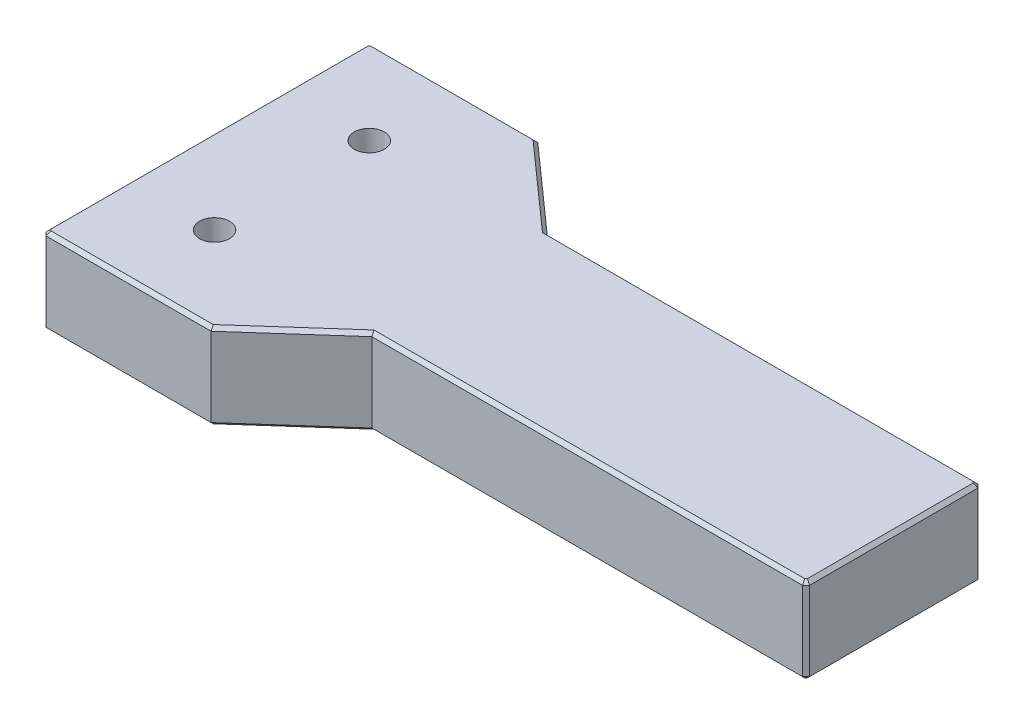
ISO-10303-21;
HEADER;
FILE_DESCRIPTION(('STEP AP214'),'2;1');
FILE_NAME('part.step','',(''),(''),'','','');
FILE_SCHEMA(('AUTOMOTIVE_DESIGN { 1 0 10303 214 1 1 1 1 }'));
ENDSEC;
DATA;
#1=APPLICATION_CONTEXT('core data for automotive mechanical design processes');
#2=APPLICATION_PROTOCOL_DEFINITION('international standard','automotive_design',2000,#1);
#3=PRODUCT_CONTEXT('',#1,'mechanical');
#4=PRODUCT('Part','Part','',(#3));
#5=PRODUCT_RELATED_PRODUCT_CATEGORY('part','',(#4));
#6=PRODUCT_DEFINITION_FORMATION('','',#4);
#7=PRODUCT_DEFINITION_CONTEXT('part definition',#1,'design');
#8=PRODUCT_DEFINITION('design','',#6,#7);
#9=PRODUCT_DEFINITION_SHAPE('','',#8);
#10=(LENGTH_UNIT() NAMED_UNIT(*) SI_UNIT(.MILLI.,.METRE.));
#11=(NAMED_UNIT(*) PLANE_ANGLE_UNIT() SI_UNIT($,.RADIAN.));
#12=(NAMED_UNIT(*) SI_UNIT($,.STERADIAN.) SOLID_ANGLE_UNIT());
#13=UNCERTAINTY_MEASURE_WITH_UNIT(LENGTH_MEASURE(1.E-05),#10,'distance_accuracy_value','');
#14=(GEOMETRIC_REPRESENTATION_CONTEXT(3) GLOBAL_UNCERTAINTY_ASSIGNED_CONTEXT((#13)) GLOBAL_UNIT_ASSIGNED_CONTEXT((#10,
#11,#12)) REPRESENTATION_CONTEXT('',''));
#15=CARTESIAN_POINT('',(0.,0.,0.));
#16=DIRECTION('',(0.,0.,1.));
#17=DIRECTION('',(1.,0.,0.));
#18=AXIS2_PLACEMENT_3D('',#15,#16,#17);
#19=CARTESIAN_POINT('',(-70.,3.,3.));
#20=DIRECTION('',(0.,-1.,0.));
#21=DIRECTION('',(1.,0.,0.));
#22=AXIS2_PLACEMENT_3D('',#19,#20,#21);
#23=CYLINDRICAL_SURFACE('',#22,1.75);
#24=CARTESIAN_POINT('',(-70.,-10.,3.));
#25=DIRECTION('',(0.,1.,0.));
#26=DIRECTION('',(1.,0.,0.));
#27=AXIS2_PLACEMENT_3D('',#24,#25,#26);
#28=CIRCLE('',#27,1.75);
#29=CARTESIAN_POINT('',(-68.25,-10.,3.));
#30=VERTEX_POINT('',#29);
#31=EDGE_CURVE('E19',#30,#30,#28,.T.);
#32=ORIENTED_EDGE('',*,*,#31,.F.);
#33=EDGE_LOOP('',(#32));
#34=FACE_BOUND('',#33,.T.);
#35=CARTESIAN_POINT('',(-70.,0.,3.));
#36=DIRECTION('',(0.,-1.,0.));
#37=DIRECTION('',(1.,0.,0.));
#38=AXIS2_PLACEMENT_3D('',#35,#36,#37);
#39=CIRCLE('',#38,1.75);
#40=CARTESIAN_POINT('',(-68.25,0.,3.));
#41=VERTEX_POINT('',#40);
#42=EDGE_CURVE('E115',#41,#41,#39,.T.);
#43=ORIENTED_EDGE('',*,*,#42,.F.);
#44=EDGE_LOOP('',(#43));
#45=FACE_BOUND('',#44,.T.);
#46=ADVANCED_FACE('F16',(#34,#45),#23,.F.);
#47=CARTESIAN_POINT('',(-70.,3.,-15.));
#48=DIRECTION('',(0.,-1.,0.));
#49=DIRECTION('',(1.,0.,0.));
#50=AXIS2_PLACEMENT_3D('',#47,#48,#49);
#51=CYLINDRICAL_SURFACE('',#50,1.75);
#52=CARTESIAN_POINT('',(-70.,-10.,-15.));
#53=DIRECTION('',(0.,1.,0.));
#54=DIRECTION('',(1.,0.,0.));
#55=AXIS2_PLACEMENT_3D('',#52,#53,#54);
#56=CIRCLE('',#55,1.75);
#57=CARTESIAN_POINT('',(-68.25,-10.,-15.));
#58=VERTEX_POINT('',#57);
#59=EDGE_CURVE('E10',#58,#58,#56,.T.);
#60=ORIENTED_EDGE('',*,*,#59,.F.);
#61=EDGE_LOOP('',(#60));
#62=FACE_BOUND('',#61,.T.);
#63=CARTESIAN_POINT('',(-70.,0.,-15.));
#64=DIRECTION('',(0.,-1.,0.));
#65=DIRECTION('',(1.,0.,0.));
#66=AXIS2_PLACEMENT_3D('',#63,#64,#65);
#67=CIRCLE('',#66,1.75);
#68=CARTESIAN_POINT('',(-68.25,0.,-15.));
#69=VERTEX_POINT('',#68);
#70=EDGE_CURVE('E234',#69,#69,#67,.T.);
#71=ORIENTED_EDGE('',*,*,#70,.F.);
#72=EDGE_LOOP('',(#71));
#73=FACE_BOUND('',#72,.T.);
#74=ADVANCED_FACE('F291',(#62,#73),#51,.F.);
#75=CARTESIAN_POINT('',(-40.,-10.,-6.));
#76=DIRECTION('',(0.,-1.,0.));
#77=DIRECTION('',(0.,0.,-1.));
#78=AXIS2_PLACEMENT_3D('',#75,#76,#77);
#79=PLANE('',#78);
#80=ORIENTED_EDGE('',*,*,#59,.T.);
#81=EDGE_LOOP('',(#80));
#82=FACE_BOUND('',#81,.T.);
#83=ORIENTED_EDGE('',*,*,#31,.T.);
#84=EDGE_LOOP('',(#83));
#85=FACE_BOUND('',#84,.T.);
#86=DIRECTION('',(-1.,0.,0.));
#87=VECTOR('',#86,1.);
#88=CARTESIAN_POINT('',(-45.25,-10.,-15.8));
#89=LINE('',#88,#87);
#90=CARTESIAN_POINT('',(-0.56568542494924,-10.,-15.8));
#91=VERTEX_POINT('',#90);
#92=CARTESIAN_POINT('',(-50.6520797289396,-10.,-15.8));
#93=VERTEX_POINT('',#92);
#94=EDGE_CURVE('E38',#91,#93,#89,.T.);
#95=ORIENTED_EDGE('',*,*,#94,.F.);
#96=DIRECTION('',(-0.707106781186543,0.,-0.707106781186552));
#97=VECTOR('',#96,1.);
#98=CARTESIAN_POINT('',(-8.03284271247449,-10.,-23.2671572875254));
#99=LINE('',#98,#97);
#100=CARTESIAN_POINT('',(-0.4,-10.,-15.6343145750508));
#101=VERTEX_POINT('',#100);
#102=EDGE_CURVE('E111',#101,#91,#99,.T.);
#103=ORIENTED_EDGE('',*,*,#102,.F.);
#104=DIRECTION('',(0.,0.,-1.));
#105=VECTOR('',#104,1.);
#106=CARTESIAN_POINT('',(-0.4,-10.,-10.9));
#107=LINE('',#106,#105);
#108=CARTESIAN_POINT('',(-0.4,-10.,3.63431457505077));
#109=VERTEX_POINT('',#108);
#110=EDGE_CURVE('E104',#109,#101,#107,.T.);
#111=ORIENTED_EDGE('',*,*,#110,.F.);
#112=DIRECTION('',(0.707106781186545,0.,-0.70710678118655));
#113=VECTOR('',#112,1.);
#114=CARTESIAN_POINT('',(-7.83284271247455,-10.,11.0671572875254));
#115=LINE('',#114,#113);
#116=CARTESIAN_POINT('',(-0.565685424949228,-10.,3.8));
#117=VERTEX_POINT('',#116);
#118=EDGE_CURVE('E242',#117,#109,#115,.T.);
#119=ORIENTED_EDGE('',*,*,#118,.F.);
#120=DIRECTION('',(1.,0.,0.));
#121=VECTOR('',#120,1.);
#122=CARTESIAN_POINT('',(-20.2,-10.,3.8));
#123=LINE('',#122,#121);
#124=CARTESIAN_POINT('',(-50.6520797289396,-10.,3.8));
#125=VERTEX_POINT('',#124);
#126=EDGE_CURVE('E241',#125,#117,#123,.T.);
#127=ORIENTED_EDGE('',*,*,#126,.F.);
#128=DIRECTION('',(0.747409318683659,0.,-0.66436383882992));
#129=VECTOR('',#128,1.);
#130=CARTESIAN_POINT('',(-45.3005731217389,-10.,-0.956894761956232));
#131=LINE('',#130,#129);
#132=CARTESIAN_POINT('',(-60.5520797289396,-10.,12.6));
#133=VERTEX_POINT('',#132);
#134=EDGE_CURVE('E249',#133,#125,#131,.T.);
#135=ORIENTED_EDGE('',*,*,#134,.F.);
#136=DIRECTION('',(1.,0.,0.));
#137=VECTOR('',#136,1.);
#138=CARTESIAN_POINT('',(-50.2,-10.,12.6));
#139=LINE('',#138,#137);
#140=CARTESIAN_POINT('',(-79.4343145750508,-10.,12.6));
#141=VERTEX_POINT('',#140);
#142=EDGE_CURVE('E252',#141,#133,#139,.T.);
#143=ORIENTED_EDGE('',*,*,#142,.F.);
#144=DIRECTION('',(0.70710678118654,0.,0.707106781186555));
#145=VECTOR('',#144,1.);
#146=CARTESIAN_POINT('',(-74.1671572875256,-10.,17.8671572875253));
#147=LINE('',#146,#145);
#148=CARTESIAN_POINT('',(-79.6,-10.,12.4343145750508));
#149=VERTEX_POINT('',#148);
#150=EDGE_CURVE('E259',#149,#141,#147,.T.);
#151=ORIENTED_EDGE('',*,*,#150,.F.);
#152=DIRECTION('',(0.,0.,1.));
#153=VECTOR('',#152,1.);
#154=CARTESIAN_POINT('',(-79.6,-10.,3.3));
#155=LINE('',#154,#153);
#156=CARTESIAN_POINT('',(-79.6,-10.,-24.4343145750507));
#157=VERTEX_POINT('',#156);
#158=EDGE_CURVE('E266',#157,#149,#155,.T.);
#159=ORIENTED_EDGE('',*,*,#158,.F.);
#160=DIRECTION('',(-0.707106781186548,0.,0.707106781186548));
#161=VECTOR('',#160,1.);
#162=CARTESIAN_POINT('',(-74.3671572875254,-10.,-29.6671572875254));
#163=LINE('',#162,#161);
#164=CARTESIAN_POINT('',(-79.4343145750507,-10.,-24.6));
#165=VERTEX_POINT('',#164);
#166=EDGE_CURVE('E77',#165,#157,#163,.T.);
#167=ORIENTED_EDGE('',*,*,#166,.F.);
#168=DIRECTION('',(-1.,0.,0.));
#169=VECTOR('',#168,1.);
#170=CARTESIAN_POINT('',(-59.8,-10.,-24.6));
#171=LINE('',#170,#169);
#172=CARTESIAN_POINT('',(-60.5520797289396,-10.,-24.6));
#173=VERTEX_POINT('',#172);
#174=EDGE_CURVE('E89',#173,#165,#171,.T.);
#175=ORIENTED_EDGE('',*,*,#174,.F.);
#176=DIRECTION('',(-0.74740931868366,0.,-0.66436383882992));
#177=VECTOR('',#176,1.);
#178=CARTESIAN_POINT('',(-50.2505731217389,-10.,-15.4431052380438));
#179=LINE('',#178,#177);
#180=EDGE_CURVE('E113',#93,#173,#179,.T.);
#181=ORIENTED_EDGE('',*,*,#180,.F.);
#182=EDGE_LOOP('',(#95,#103,#111,#119,#127,#135,#143,#151,#159,#167,#175,#181));
#183=FACE_BOUND('',#182,.T.);
#184=ADVANCED_FACE('F109',(#82,#85,#183),#79,.T.);
#185=CARTESIAN_POINT('',(-40.,0.,-6.));
#186=DIRECTION('',(0.,-1.,0.));
#187=DIRECTION('',(0.,0.,-1.));
#188=AXIS2_PLACEMENT_3D('',#185,#186,#187);
#189=PLANE('',#188);
#190=ORIENTED_EDGE('',*,*,#70,.T.);
#191=EDGE_LOOP('',(#190));
#192=FACE_BOUND('',#191,.T.);
#193=ORIENTED_EDGE('',*,*,#42,.T.);
#194=EDGE_LOOP('',(#193));
#195=FACE_BOUND('',#194,.T.);
#196=DIRECTION('',(-1.,0.,0.));
#197=VECTOR('',#196,1.);
#198=CARTESIAN_POINT('',(-50.2,0.,12.6));
#199=LINE('',#198,#197);
#200=CARTESIAN_POINT('',(-60.5520797289396,0.,12.6));
#201=VERTEX_POINT('',#200);
#202=CARTESIAN_POINT('',(-79.4343145750508,0.,12.6));
#203=VERTEX_POINT('',#202);
#204=EDGE_CURVE('E143',#201,#203,#199,.T.);
#205=ORIENTED_EDGE('',*,*,#204,.F.);
#206=DIRECTION('',(-0.747409318683659,0.,0.66436383882992));
#207=VECTOR('',#206,1.);
#208=CARTESIAN_POINT('',(-45.3005731217389,0.,-0.956894761956232));
#209=LINE('',#208,#207);
#210=CARTESIAN_POINT('',(-50.6520797289396,0.,3.8));
#211=VERTEX_POINT('',#210);
#212=EDGE_CURVE('E307',#211,#201,#209,.T.);
#213=ORIENTED_EDGE('',*,*,#212,.F.);
#214=DIRECTION('',(-1.,0.,0.));
#215=VECTOR('',#214,1.);
#216=CARTESIAN_POINT('',(-20.2,0.,3.8));
#217=LINE('',#216,#215);
#218=CARTESIAN_POINT('',(-0.565685424949229,0.,3.8));
#219=VERTEX_POINT('',#218);
#220=EDGE_CURVE('E145',#219,#211,#217,.T.);
#221=ORIENTED_EDGE('',*,*,#220,.F.);
#222=DIRECTION('',(-0.707106781186545,0.,0.70710678118655));
#223=VECTOR('',#222,1.);
#224=CARTESIAN_POINT('',(-7.83284271247455,0.,11.0671572875254));
#225=LINE('',#224,#223);
#226=CARTESIAN_POINT('',(-0.4,0.,3.63431457505077));
#227=VERTEX_POINT('',#226);
#228=EDGE_CURVE('E154',#227,#219,#225,.T.);
#229=ORIENTED_EDGE('',*,*,#228,.F.);
#230=DIRECTION('',(0.,0.,1.));
#231=VECTOR('',#230,1.);
#232=CARTESIAN_POINT('',(-0.4,0.,-10.9));
#233=LINE('',#232,#231);
#234=CARTESIAN_POINT('',(-0.4,0.,-15.6343145750508));
#235=VERTEX_POINT('',#234);
#236=EDGE_CURVE('E166',#235,#227,#233,.T.);
#237=ORIENTED_EDGE('',*,*,#236,.F.);
#238=DIRECTION('',(0.707106781186543,0.,0.707106781186552));
#239=VECTOR('',#238,1.);
#240=CARTESIAN_POINT('',(-8.03284271247449,0.,-23.2671572875254));
#241=LINE('',#240,#239);
#242=CARTESIAN_POINT('',(-0.565685424949236,0.,-15.8));
#243=VERTEX_POINT('',#242);
#244=EDGE_CURVE('E184',#243,#235,#241,.T.);
#245=ORIENTED_EDGE('',*,*,#244,.F.);
#246=DIRECTION('',(1.,0.,0.));
#247=VECTOR('',#246,1.);
#248=CARTESIAN_POINT('',(-45.25,0.,-15.8));
#249=LINE('',#248,#247);
#250=CARTESIAN_POINT('',(-50.6520797289396,0.,-15.8));
#251=VERTEX_POINT('',#250);
#252=EDGE_CURVE('E185',#251,#243,#249,.T.);
#253=ORIENTED_EDGE('',*,*,#252,.F.);
#254=DIRECTION('',(0.74740931868366,0.,0.66436383882992));
#255=VECTOR('',#254,1.);
#256=CARTESIAN_POINT('',(-50.2505731217389,0.,-15.4431052380438));
#257=LINE('',#256,#255);
#258=CARTESIAN_POINT('',(-60.5520797289396,0.,-24.6));
#259=VERTEX_POINT('',#258);
#260=EDGE_CURVE('E424',#259,#251,#257,.T.);
#261=ORIENTED_EDGE('',*,*,#260,.F.);
#262=DIRECTION('',(1.,0.,0.));
#263=VECTOR('',#262,1.);
#264=CARTESIAN_POINT('',(-59.8,0.,-24.6));
#265=LINE('',#264,#263);
#266=CARTESIAN_POINT('',(-79.4343145750507,0.,-24.6));
#267=VERTEX_POINT('',#266);
#268=EDGE_CURVE('E439',#267,#259,#265,.T.);
#269=ORIENTED_EDGE('',*,*,#268,.F.);
#270=DIRECTION('',(0.707106781186548,0.,-0.707106781186548));
#271=VECTOR('',#270,1.);
#272=CARTESIAN_POINT('',(-74.3671572875254,0.,-29.6671572875254));
#273=LINE('',#272,#271);
#274=CARTESIAN_POINT('',(-79.6,0.,-24.4343145750507));
#275=VERTEX_POINT('',#274);
#276=EDGE_CURVE('E374',#275,#267,#273,.T.);
#277=ORIENTED_EDGE('',*,*,#276,.F.);
#278=DIRECTION('',(0.,0.,-1.));
#279=VECTOR('',#278,1.);
#280=CARTESIAN_POINT('',(-79.6,0.,3.3));
#281=LINE('',#280,#279);
#282=CARTESIAN_POINT('',(-79.6,0.,12.4343145750508));
#283=VERTEX_POINT('',#282);
#284=EDGE_CURVE('E455',#283,#275,#281,.T.);
#285=ORIENTED_EDGE('',*,*,#284,.F.);
#286=DIRECTION('',(-0.70710678118654,0.,-0.707106781186555));
#287=VECTOR('',#286,1.);
#288=CARTESIAN_POINT('',(-74.1671572875256,0.,17.8671572875253));
#289=LINE('',#288,#287);
#290=EDGE_CURVE('E311',#203,#283,#289,.T.);
#291=ORIENTED_EDGE('',*,*,#290,.F.);
#292=EDGE_LOOP('',(#205,#213,#221,#229,#237,#245,#253,#261,#269,#277,#285,#291));
#293=FACE_BOUND('',#292,.T.);
#294=ADVANCED_FACE('F294',(#192,#195,#293),#189,.F.);
#295=CARTESIAN_POINT('',(-45.25,-9.8,-16.));
#296=DIRECTION('',(0.,-0.707106781186548,-0.707106781186548));
#297=DIRECTION('',(0.,-0.707106781186548,0.707106781186548));
#298=AXIS2_PLACEMENT_3D('',#295,#296,#297);
#299=PLANE('',#298);
#300=ORIENTED_EDGE('',*,*,#94,.T.);
#301=DIRECTION('',(0.259622959338956,0.68286013171955,-0.68286013171955));
#302=VECTOR('',#301,1.);
#303=CARTESIAN_POINT('',(-50.6520797289396,-10.,-15.8));
#304=LINE('',#303,#302);
#305=CARTESIAN_POINT('',(-50.5,-9.6,-16.2));
#306=VERTEX_POINT('',#305);
#307=EDGE_CURVE('E116',#93,#306,#304,.T.);
#308=ORIENTED_EDGE('',*,*,#307,.T.);
#309=DIRECTION('',(1.,0.,0.));
#310=VECTOR('',#309,1.);
#311=CARTESIAN_POINT('',(-45.25,-9.6,-16.2));
#312=LINE('',#311,#310);
#313=CARTESIAN_POINT('',(-0.4,-9.6,-16.2));
#314=VERTEX_POINT('',#313);
#315=EDGE_CURVE('E124',#306,#314,#312,.T.);
#316=ORIENTED_EDGE('',*,*,#315,.T.);
#317=DIRECTION('',(0.281084637714824,0.678598344545846,-0.678598344545846));
#318=VECTOR('',#317,1.);
#319=CARTESIAN_POINT('',(-0.56568542494924,-10.,-15.8));
#320=LINE('',#319,#318);
#321=EDGE_CURVE('E120',#91,#314,#320,.T.);
#322=ORIENTED_EDGE('',*,*,#321,.F.);
#323=EDGE_LOOP('',(#300,#308,#316,#322));
#324=FACE_BOUND('',#323,.T.);
#325=ADVANCED_FACE('F121',(#324),#299,.T.);
#326=CARTESIAN_POINT('',(-50.1177003539729,-9.8,-15.5925871017805));
#327=DIRECTION('',(0.46977617561176,-0.707106781186551,-0.52849819756323));
#328=DIRECTION('',(0.,0.598671094713961,-0.800994956509707));
#329=AXIS2_PLACEMENT_3D('',#326,#327,#328);
#330=PLANE('',#329);
#331=ORIENTED_EDGE('',*,*,#180,.T.);
#332=DIRECTION('',(0.259622959338956,0.68286013171955,-0.68286013171955));
#333=VECTOR('',#332,1.);
#334=CARTESIAN_POINT('',(-60.5520797289396,-10.,-24.6));
#335=LINE('',#334,#333);
#336=CARTESIAN_POINT('',(-60.4,-9.6,-25.));
#337=VERTEX_POINT('',#336);
#338=EDGE_CURVE('E271',#173,#337,#335,.T.);
#339=ORIENTED_EDGE('',*,*,#338,.T.);
#340=DIRECTION('',(0.74740931868366,0.,0.66436383882992));
#341=VECTOR('',#340,1.);
#342=CARTESIAN_POINT('',(-49.9848275862069,-9.6,-15.7420689655172));
#343=LINE('',#342,#341);
#344=EDGE_CURVE('E392',#337,#306,#343,.T.);
#345=ORIENTED_EDGE('',*,*,#344,.T.);
#346=ORIENTED_EDGE('',*,*,#307,.F.);
#347=EDGE_LOOP('',(#331,#339,#345,#346));
#348=FACE_BOUND('',#347,.T.);
#349=ADVANCED_FACE('F671',(#348),#330,.T.);
#350=CARTESIAN_POINT('',(-59.8,-9.8,-24.8));
#351=DIRECTION('',(0.,-0.707106781186548,-0.707106781186548));
#352=DIRECTION('',(0.,-0.707106781186548,0.707106781186548));
#353=AXIS2_PLACEMENT_3D('',#350,#351,#352);
#354=PLANE('',#353);
#355=ORIENTED_EDGE('',*,*,#174,.T.);
#356=DIRECTION('',(-0.281084637714837,0.678598344545844,-0.678598344545844));
#357=VECTOR('',#356,1.);
#358=CARTESIAN_POINT('',(-79.4343145750507,-10.,-24.6));
#359=LINE('',#358,#357);
#360=CARTESIAN_POINT('',(-79.6,-9.6,-25.));
#361=VERTEX_POINT('',#360);
#362=EDGE_CURVE('E214',#165,#361,#359,.T.);
#363=ORIENTED_EDGE('',*,*,#362,.T.);
#364=DIRECTION('',(1.,0.,0.));
#365=VECTOR('',#364,1.);
#366=CARTESIAN_POINT('',(-59.8,-9.6,-25.));
#367=LINE('',#366,#365);
#368=EDGE_CURVE('E366',#361,#337,#367,.T.);
#369=ORIENTED_EDGE('',*,*,#368,.T.);
#370=ORIENTED_EDGE('',*,*,#338,.F.);
#371=EDGE_LOOP('',(#355,#363,#369,#370));
#372=FACE_BOUND('',#371,.T.);
#373=ADVANCED_FACE('F668',(#372),#354,.T.);
#374=CARTESIAN_POINT('',(-74.5085786437627,-9.8,-29.8085786437627));
#375=DIRECTION('',(-0.499999999999993,-0.707106781186557,-0.499999999999993));
#376=DIRECTION('',(0.,0.577350269189615,-0.816496580927734));
#377=AXIS2_PLACEMENT_3D('',#374,#375,#376);
#378=PLANE('',#377);
#379=ORIENTED_EDGE('',*,*,#166,.T.);
#380=DIRECTION('',(-0.678598344545844,0.678598344545844,-0.281084637714837));
#381=VECTOR('',#380,1.);
#382=CARTESIAN_POINT('',(-79.6,-10.,-24.4343145750507));
#383=LINE('',#382,#381);
#384=CARTESIAN_POINT('',(-80.,-9.6,-24.6));
#385=VERTEX_POINT('',#384);
#386=EDGE_CURVE('E215',#157,#385,#383,.T.);
#387=ORIENTED_EDGE('',*,*,#386,.T.);
#388=DIRECTION('',(0.707106781186548,0.,-0.707106781186548));
#389=VECTOR('',#388,1.);
#390=CARTESIAN_POINT('',(-74.65,-9.6,-29.95));
#391=LINE('',#390,#389);
#392=EDGE_CURVE('E367',#385,#361,#391,.T.);
#393=ORIENTED_EDGE('',*,*,#392,.T.);
#394=ORIENTED_EDGE('',*,*,#362,.F.);
#395=EDGE_LOOP('',(#379,#387,#393,#394));
#396=FACE_BOUND('',#395,.T.);
#397=ADVANCED_FACE('F664',(#396),#378,.T.);
#398=CARTESIAN_POINT('',(-79.8,-9.8,3.3));
#399=DIRECTION('',(-0.707106781186548,-0.707106781186548,0.));
#400=DIRECTION('',(-0.707106781186548,0.707106781186548,0.));
#401=AXIS2_PLACEMENT_3D('',#398,#399,#400);
#402=PLANE('',#401);
#403=ORIENTED_EDGE('',*,*,#158,.T.);
#404=DIRECTION('',(-0.678598344545849,0.678598344545849,0.281084637714809));
#405=VECTOR('',#404,1.);
#406=CARTESIAN_POINT('',(-79.6,-10.,12.4343145750508));
#407=LINE('',#406,#405);
#408=CARTESIAN_POINT('',(-80.,-9.6,12.6));
#409=VERTEX_POINT('',#408);
#410=EDGE_CURVE('E262',#149,#409,#407,.T.);
#411=ORIENTED_EDGE('',*,*,#410,.T.);
#412=DIRECTION('',(0.,0.,-1.));
#413=VECTOR('',#412,1.);
#414=CARTESIAN_POINT('',(-80.,-9.6,3.3));
#415=LINE('',#414,#413);
#416=EDGE_CURVE('E351',#409,#385,#415,.T.);
#417=ORIENTED_EDGE('',*,*,#416,.T.);
#418=ORIENTED_EDGE('',*,*,#386,.F.);
#419=EDGE_LOOP('',(#403,#411,#417,#418));
#420=FACE_BOUND('',#419,.T.);
#421=ADVANCED_FACE('F660',(#420),#402,.T.);
#422=CARTESIAN_POINT('',(-74.3085786437629,-9.8,18.0085786437626));
#423=DIRECTION('',(-0.500000000000007,-0.707106781186546,0.5));
#424=DIRECTION('',(-0.816496580927722,0.577350269189632,0.));
#425=AXIS2_PLACEMENT_3D('',#422,#423,#424);
#426=PLANE('',#425);
#427=ORIENTED_EDGE('',*,*,#150,.T.);
#428=DIRECTION('',(-0.281084637714808,0.678598344545846,0.678598344545853));
#429=VECTOR('',#428,1.);
#430=CARTESIAN_POINT('',(-79.4343145750508,-10.,12.6));
#431=LINE('',#430,#429);
#432=CARTESIAN_POINT('',(-79.6,-9.6,13.));
#433=VERTEX_POINT('',#432);
#434=EDGE_CURVE('E255',#141,#433,#431,.T.);
#435=ORIENTED_EDGE('',*,*,#434,.T.);
#436=DIRECTION('',(-0.70710678118654,0.,-0.707106781186555));
#437=VECTOR('',#436,1.);
#438=CARTESIAN_POINT('',(-74.45,-9.6,18.15));
#439=LINE('',#438,#437);
#440=EDGE_CURVE('E1200',#433,#409,#439,.T.);
#441=ORIENTED_EDGE('',*,*,#440,.T.);
#442=ORIENTED_EDGE('',*,*,#410,.F.);
#443=EDGE_LOOP('',(#427,#435,#441,#442));
#444=FACE_BOUND('',#443,.T.);
#445=ADVANCED_FACE('F656',(#444),#426,.T.);
#446=CARTESIAN_POINT('',(-50.2,-9.8,12.8));
#447=DIRECTION('',(0.,-0.707106781186551,0.707106781186544));
#448=DIRECTION('',(-1.,0.,0.));
#449=AXIS2_PLACEMENT_3D('',#446,#447,#448);
#450=PLANE('',#449);
#451=ORIENTED_EDGE('',*,*,#142,.T.);
#452=DIRECTION('',(0.25962295933894,0.682860131719548,0.682860131719559));
#453=VECTOR('',#452,1.);
#454=CARTESIAN_POINT('',(-60.5520797289396,-10.,12.6));
#455=LINE('',#454,#453);
#456=CARTESIAN_POINT('',(-60.4,-9.6,13.));
#457=VERTEX_POINT('',#456);
#458=EDGE_CURVE('E245',#133,#457,#455,.T.);
#459=ORIENTED_EDGE('',*,*,#458,.T.);
#460=DIRECTION('',(-1.,0.,0.));
#461=VECTOR('',#460,1.);
#462=CARTESIAN_POINT('',(-50.2,-9.6,13.));
#463=LINE('',#462,#461);
#464=EDGE_CURVE('E405',#457,#433,#463,.T.);
#465=ORIENTED_EDGE('',*,*,#464,.T.);
#466=ORIENTED_EDGE('',*,*,#434,.F.);
#467=EDGE_LOOP('',(#451,#459,#465,#466));
#468=FACE_BOUND('',#467,.T.);
#469=ADVANCED_FACE('F652',(#468),#450,.T.);
#470=CARTESIAN_POINT('',(-45.1677003539729,-9.8,-0.807412898219499));
#471=DIRECTION('',(0.469776175611761,-0.707106781186551,0.52849819756323));
#472=DIRECTION('',(-0.832934513816197,-0.553371571092856,0.));
#473=AXIS2_PLACEMENT_3D('',#470,#471,#472);
#474=PLANE('',#473);
#475=DIRECTION('',(-0.747409318683659,0.,0.66436383882992));
#476=VECTOR('',#475,1.);
#477=CARTESIAN_POINT('',(-45.0348275862069,-9.6,-0.657931034482766));
#478=LINE('',#477,#476);
#479=CARTESIAN_POINT('',(-50.5,-9.6,4.2));
#480=VERTEX_POINT('',#479);
#481=EDGE_CURVE('E139',#480,#457,#478,.T.);
#482=ORIENTED_EDGE('',*,*,#481,.T.);
#483=ORIENTED_EDGE('',*,*,#458,.F.);
#484=ORIENTED_EDGE('',*,*,#134,.T.);
#485=DIRECTION('',(0.259622959338956,0.68286013171955,0.68286013171955));
#486=VECTOR('',#485,1.);
#487=CARTESIAN_POINT('',(-50.6520797289396,-10.,3.8));
#488=LINE('',#487,#486);
#489=EDGE_CURVE('E238',#125,#480,#488,.T.);
#490=ORIENTED_EDGE('',*,*,#489,.T.);
#491=EDGE_LOOP('',(#482,#483,#484,#490));
#492=FACE_BOUND('',#491,.T.);
#493=ADVANCED_FACE('F575',(#492),#474,.T.);
#494=CARTESIAN_POINT('',(-20.2,-9.8,4.));
#495=DIRECTION('',(0.,-0.707106781186548,0.707106781186548));
#496=DIRECTION('',(-1.,0.,0.));
#497=AXIS2_PLACEMENT_3D('',#494,#495,#496);
#498=PLANE('',#497);
#499=DIRECTION('',(-1.,0.,0.));
#500=VECTOR('',#499,1.);
#501=CARTESIAN_POINT('',(-20.2,-9.6,4.2));
#502=LINE('',#501,#500);
#503=CARTESIAN_POINT('',(-0.4,-9.6,4.2));
#504=VERTEX_POINT('',#503);
#505=EDGE_CURVE('E171',#504,#480,#502,.T.);
#506=ORIENTED_EDGE('',*,*,#505,.T.);
#507=ORIENTED_EDGE('',*,*,#489,.F.);
#508=ORIENTED_EDGE('',*,*,#126,.T.);
#509=DIRECTION('',(0.281084637714804,0.678598344545849,0.678598344545851));
#510=VECTOR('',#509,1.);
#511=CARTESIAN_POINT('',(-0.565685424949228,-10.,3.8));
#512=LINE('',#511,#510);
#513=EDGE_CURVE('E237',#117,#504,#512,.T.);
#514=ORIENTED_EDGE('',*,*,#513,.T.);
#515=EDGE_LOOP('',(#506,#507,#508,#514));
#516=FACE_BOUND('',#515,.T.);
#517=ADVANCED_FACE('F556',(#516),#498,.T.);
#518=CARTESIAN_POINT('',(-7.69142135623724,-9.8,11.2085786437627));
#519=DIRECTION('',(0.500000000000006,-0.707106781186542,0.5));
#520=DIRECTION('',(0.,-0.57735026918963,-0.816496580927723));
#521=AXIS2_PLACEMENT_3D('',#518,#519,#520);
#522=PLANE('',#521);
#523=DIRECTION('',(-0.707106781186545,0.,0.70710678118655));
#524=VECTOR('',#523,1.);
#525=CARTESIAN_POINT('',(-7.55,-9.6,11.35));
#526=LINE('',#525,#524);
#527=CARTESIAN_POINT('',(0.,-9.6,3.8));
#528=VERTEX_POINT('',#527);
#529=EDGE_CURVE('E193',#528,#504,#526,.T.);
#530=ORIENTED_EDGE('',*,*,#529,.T.);
#531=ORIENTED_EDGE('',*,*,#513,.F.);
#532=ORIENTED_EDGE('',*,*,#118,.T.);
#533=DIRECTION('',(0.67859834454585,0.67859834454585,0.281084637714806));
#534=VECTOR('',#533,1.);
#535=CARTESIAN_POINT('',(-0.4,-10.,3.63431457505077));
#536=LINE('',#535,#534);
#537=EDGE_CURVE('E129',#109,#528,#536,.T.);
#538=ORIENTED_EDGE('',*,*,#537,.T.);
#539=EDGE_LOOP('',(#530,#531,#532,#538));
#540=FACE_BOUND('',#539,.T.);
#541=ADVANCED_FACE('F565',(#540),#522,.T.);
#542=CARTESIAN_POINT('',(-0.2,-9.8,-10.9));
#543=DIRECTION('',(0.707106781186548,-0.707106781186548,0.));
#544=DIRECTION('',(0.,0.,-1.));
#545=AXIS2_PLACEMENT_3D('',#542,#543,#544);
#546=PLANE('',#545);
#547=DIRECTION('',(0.,0.,1.));
#548=VECTOR('',#547,1.);
#549=CARTESIAN_POINT('',(0.,-9.6,-10.9));
#550=LINE('',#549,#548);
#551=CARTESIAN_POINT('',(0.,-9.6,-15.8));
#552=VERTEX_POINT('',#551);
#553=EDGE_CURVE('E219',#552,#528,#550,.T.);
#554=ORIENTED_EDGE('',*,*,#553,.T.);
#555=ORIENTED_EDGE('',*,*,#537,.F.);
#556=ORIENTED_EDGE('',*,*,#110,.T.);
#557=DIRECTION('',(0.678598344545846,0.678598344545846,-0.281084637714823));
#558=VECTOR('',#557,1.);
#559=CARTESIAN_POINT('',(-0.4,-10.,-15.6343145750508));
#560=LINE('',#559,#558);
#561=EDGE_CURVE('E132',#101,#552,#560,.T.);
#562=ORIENTED_EDGE('',*,*,#561,.T.);
#563=EDGE_LOOP('',(#554,#555,#556,#562));
#564=FACE_BOUND('',#563,.T.);
#565=ADVANCED_FACE('F567',(#564),#546,.T.);
#566=CARTESIAN_POINT('',(-7.89142135623718,-9.8,-23.4085786437627));
#567=DIRECTION('',(0.5,-0.707106781186545,-0.5));
#568=DIRECTION('',(0.,0.577350269189626,-0.816496580927726));
#569=AXIS2_PLACEMENT_3D('',#566,#567,#568);
#570=PLANE('',#569);
#571=DIRECTION('',(0.707106781186543,0.,0.707106781186552));
#572=VECTOR('',#571,1.);
#573=CARTESIAN_POINT('',(-7.74999999999988,-9.6,-23.55));
#574=LINE('',#573,#572);
#575=EDGE_CURVE('E208',#314,#552,#574,.T.);
#576=ORIENTED_EDGE('',*,*,#575,.T.);
#577=ORIENTED_EDGE('',*,*,#561,.F.);
#578=ORIENTED_EDGE('',*,*,#102,.T.);
#579=ORIENTED_EDGE('',*,*,#321,.T.);
#580=EDGE_LOOP('',(#576,#577,#578,#579));
#581=FACE_BOUND('',#580,.T.);
#582=ADVANCED_FACE('F131',(#581),#570,.T.);
#583=CARTESIAN_POINT('',(-50.5,0.,4.2));
#584=DIRECTION('',(0.66436383882992,0.,0.74740931868366));
#585=DIRECTION('',(0.,-1.,0.));
#586=AXIS2_PLACEMENT_3D('',#583,#584,#585);
#587=PLANE('',#586);
#588=ORIENTED_EDGE('',*,*,#481,.F.);
#589=DIRECTION('',(0.,-1.,0.));
#590=VECTOR('',#589,1.);
#591=CARTESIAN_POINT('',(-50.5,0.,4.2));
#592=LINE('',#591,#590);
#593=CARTESIAN_POINT('',(-50.5,-0.4,4.2));
#594=VERTEX_POINT('',#593);
#595=EDGE_CURVE('E167',#594,#480,#592,.T.);
#596=ORIENTED_EDGE('',*,*,#595,.F.);
#597=DIRECTION('',(0.747409318683659,0.,-0.66436383882992));
#598=VECTOR('',#597,1.);
#599=CARTESIAN_POINT('',(-45.0348275862069,-0.4,-0.657931034482766));
#600=LINE('',#599,#598);
#601=CARTESIAN_POINT('',(-60.4,-0.4,13.));
#602=VERTEX_POINT('',#601);
#603=EDGE_CURVE('E331',#602,#594,#600,.T.);
#604=ORIENTED_EDGE('',*,*,#603,.F.);
#605=DIRECTION('',(0.,-1.,0.));
#606=VECTOR('',#605,1.);
#607=CARTESIAN_POINT('',(-60.4,0.,13.));
#608=LINE('',#607,#606);
#609=EDGE_CURVE('E408',#602,#457,#608,.T.);
#610=ORIENTED_EDGE('',*,*,#609,.T.);
#611=EDGE_LOOP('',(#588,#596,#604,#610));
#612=FACE_BOUND('',#611,.T.);
#613=ADVANCED_FACE('F483',(#612),#587,.T.);
#614=CARTESIAN_POINT('',(-0.4,0.,4.2));
#615=DIRECTION('',(0.,0.,1.));
#616=DIRECTION('',(1.,0.,0.));
#617=AXIS2_PLACEMENT_3D('',#614,#615,#616);
#618=PLANE('',#617);
#619=ORIENTED_EDGE('',*,*,#505,.F.);
#620=DIRECTION('',(0.,-1.,0.));
#621=VECTOR('',#620,1.);
#622=CARTESIAN_POINT('',(-0.4,0.,4.2));
#623=LINE('',#622,#621);
#624=CARTESIAN_POINT('',(-0.4,-0.4,4.2));
#625=VERTEX_POINT('',#624);
#626=EDGE_CURVE('E197',#625,#504,#623,.T.);
#627=ORIENTED_EDGE('',*,*,#626,.F.);
#628=DIRECTION('',(1.,0.,0.));
#629=VECTOR('',#628,1.);
#630=CARTESIAN_POINT('',(-20.2,-0.4,4.2));
#631=LINE('',#630,#629);
#632=EDGE_CURVE('E149',#594,#625,#631,.T.);
#633=ORIENTED_EDGE('',*,*,#632,.F.);
#634=ORIENTED_EDGE('',*,*,#595,.T.);
#635=EDGE_LOOP('',(#619,#627,#633,#634));
#636=FACE_BOUND('',#635,.T.);
#637=ADVANCED_FACE('F561',(#636),#618,.T.);
#638=CARTESIAN_POINT('',(0.,0.,3.8));
#639=DIRECTION('',(0.70710678118655,0.,0.707106781186545));
#640=DIRECTION('',(0.,-1.,0.));
#641=AXIS2_PLACEMENT_3D('',#638,#639,#640);
#642=PLANE('',#641);
#643=ORIENTED_EDGE('',*,*,#529,.F.);
#644=DIRECTION('',(0.,-1.,0.));
#645=VECTOR('',#644,1.);
#646=CARTESIAN_POINT('',(0.,0.,3.8));
#647=LINE('',#646,#645);
#648=CARTESIAN_POINT('',(0.,-0.4,3.8));
#649=VERTEX_POINT('',#648);
#650=EDGE_CURVE('E198',#649,#528,#647,.T.);
#651=ORIENTED_EDGE('',*,*,#650,.F.);
#652=DIRECTION('',(0.707106781186545,0.,-0.70710678118655));
#653=VECTOR('',#652,1.);
#654=CARTESIAN_POINT('',(-7.55,-0.4,11.35));
#655=LINE('',#654,#653);
#656=EDGE_CURVE('E158',#625,#649,#655,.T.);
#657=ORIENTED_EDGE('',*,*,#656,.F.);
#658=ORIENTED_EDGE('',*,*,#626,.T.);
#659=EDGE_LOOP('',(#643,#651,#657,#658));
#660=FACE_BOUND('',#659,.T.);
#661=ADVANCED_FACE('F564',(#660),#642,.T.);
#662=CARTESIAN_POINT('',(0.,0.,-15.8));
#663=DIRECTION('',(1.,0.,0.));
#664=DIRECTION('',(0.,1.,0.));
#665=AXIS2_PLACEMENT_3D('',#662,#663,#664);
#666=PLANE('',#665);
#667=ORIENTED_EDGE('',*,*,#553,.F.);
#668=DIRECTION('',(0.,-1.,0.));
#669=VECTOR('',#668,1.);
#670=CARTESIAN_POINT('',(0.,0.,-15.8));
#671=LINE('',#670,#669);
#672=CARTESIAN_POINT('',(0.,-0.4,-15.8));
#673=VERTEX_POINT('',#672);
#674=EDGE_CURVE('E211',#673,#552,#671,.T.);
#675=ORIENTED_EDGE('',*,*,#674,.F.);
#676=DIRECTION('',(0.,0.,-1.));
#677=VECTOR('',#676,1.);
#678=CARTESIAN_POINT('',(0.,-0.4,-10.9));
#679=LINE('',#678,#677);
#680=EDGE_CURVE('E175',#649,#673,#679,.T.);
#681=ORIENTED_EDGE('',*,*,#680,.F.);
#682=ORIENTED_EDGE('',*,*,#650,.T.);
#683=EDGE_LOOP('',(#667,#675,#681,#682));
#684=FACE_BOUND('',#683,.T.);
#685=ADVANCED_FACE('F639',(#684),#666,.T.);
#686=CARTESIAN_POINT('',(-0.4,0.,-16.2));
#687=DIRECTION('',(0.707106781186552,0.,-0.707106781186543));
#688=DIRECTION('',(0.,-1.,0.));
#689=AXIS2_PLACEMENT_3D('',#686,#687,#688);
#690=PLANE('',#689);
#691=ORIENTED_EDGE('',*,*,#575,.F.);
#692=DIRECTION('',(0.,-1.,0.));
#693=VECTOR('',#692,1.);
#694=CARTESIAN_POINT('',(-0.4,0.,-16.2));
#695=LINE('',#694,#693);
#696=CARTESIAN_POINT('',(-0.4,-0.4,-16.2));
#697=VERTEX_POINT('',#696);
#698=EDGE_CURVE('E201',#697,#314,#695,.T.);
#699=ORIENTED_EDGE('',*,*,#698,.F.);
#700=DIRECTION('',(-0.707106781186543,0.,-0.707106781186552));
#701=VECTOR('',#700,1.);
#702=CARTESIAN_POINT('',(-7.74999999999988,-0.4,-23.55));
#703=LINE('',#702,#701);
#704=EDGE_CURVE('E179',#673,#697,#703,.T.);
#705=ORIENTED_EDGE('',*,*,#704,.F.);
#706=ORIENTED_EDGE('',*,*,#674,.T.);
#707=EDGE_LOOP('',(#691,#699,#705,#706));
#708=FACE_BOUND('',#707,.T.);
#709=ADVANCED_FACE('F635',(#708),#690,.T.);
#710=CARTESIAN_POINT('',(-50.5,0.,-16.2));
#711=DIRECTION('',(0.,0.,-1.));
#712=DIRECTION('',(0.,-1.,0.));
#713=AXIS2_PLACEMENT_3D('',#710,#711,#712);
#714=PLANE('',#713);
#715=ORIENTED_EDGE('',*,*,#315,.F.);
#716=DIRECTION('',(0.,-1.,0.));
#717=VECTOR('',#716,1.);
#718=CARTESIAN_POINT('',(-50.5,0.,-16.2));
#719=LINE('',#718,#717);
#720=CARTESIAN_POINT('',(-50.5,-0.4,-16.2));
#721=VERTEX_POINT('',#720);
#722=EDGE_CURVE('E391',#721,#306,#719,.T.);
#723=ORIENTED_EDGE('',*,*,#722,.F.);
#724=DIRECTION('',(-1.,0.,0.));
#725=VECTOR('',#724,1.);
#726=CARTESIAN_POINT('',(-45.25,-0.4,-16.2));
#727=LINE('',#726,#725);
#728=EDGE_CURVE('E189',#697,#721,#727,.T.);
#729=ORIENTED_EDGE('',*,*,#728,.F.);
#730=ORIENTED_EDGE('',*,*,#698,.T.);
#731=EDGE_LOOP('',(#715,#723,#729,#730));
#732=FACE_BOUND('',#731,.T.);
#733=ADVANCED_FACE('F631',(#732),#714,.T.);
#734=CARTESIAN_POINT('',(-45.25,-0.2,-16.));
#735=DIRECTION('',(0.,0.707106781186548,-0.707106781186547));
#736=DIRECTION('',(-1.,0.,0.));
#737=AXIS2_PLACEMENT_3D('',#734,#735,#736);
#738=PLANE('',#737);
#739=ORIENTED_EDGE('',*,*,#252,.T.);
#740=DIRECTION('',(0.281084637714819,-0.678598344545847,-0.678598344545848));
#741=VECTOR('',#740,1.);
#742=CARTESIAN_POINT('',(-0.565685424949237,0.,-15.8));
#743=LINE('',#742,#741);
#744=EDGE_CURVE('E183',#243,#697,#743,.T.);
#745=ORIENTED_EDGE('',*,*,#744,.T.);
#746=ORIENTED_EDGE('',*,*,#728,.T.);
#747=DIRECTION('',(0.259622959338956,-0.68286013171955,-0.68286013171955));
#748=VECTOR('',#747,1.);
#749=CARTESIAN_POINT('',(-50.6520797289396,0.,-15.8));
#750=LINE('',#749,#748);
#751=EDGE_CURVE('E428',#251,#721,#750,.T.);
#752=ORIENTED_EDGE('',*,*,#751,.F.);
#753=EDGE_LOOP('',(#739,#745,#746,#752));
#754=FACE_BOUND('',#753,.T.);
#755=ADVANCED_FACE('F627',(#754),#738,.T.);
#756=CARTESIAN_POINT('',(-7.89142135623718,-0.2,-23.4085786437627));
#757=DIRECTION('',(0.5,0.707106781186546,-0.5));
#758=DIRECTION('',(-0.707106781186543,0.,-0.707106781186553));
#759=AXIS2_PLACEMENT_3D('',#756,#757,#758);
#760=PLANE('',#759);
#761=ORIENTED_EDGE('',*,*,#244,.T.);
#762=DIRECTION('',(0.678598344545848,-0.678598344545848,-0.281084637714816));
#763=VECTOR('',#762,1.);
#764=CARTESIAN_POINT('',(-0.4,0.,-15.6343145750508));
#765=LINE('',#764,#763);
#766=EDGE_CURVE('E448',#235,#673,#765,.T.);
#767=ORIENTED_EDGE('',*,*,#766,.T.);
#768=ORIENTED_EDGE('',*,*,#704,.T.);
#769=ORIENTED_EDGE('',*,*,#744,.F.);
#770=EDGE_LOOP('',(#761,#767,#768,#769));
#771=FACE_BOUND('',#770,.T.);
#772=ADVANCED_FACE('F623',(#771),#760,.T.);
#773=CARTESIAN_POINT('',(-0.2,-0.2,-10.9));
#774=DIRECTION('',(0.707106781186547,0.707106781186548,0.));
#775=DIRECTION('',(0.,0.,-1.));
#776=AXIS2_PLACEMENT_3D('',#773,#774,#775);
#777=PLANE('',#776);
#778=ORIENTED_EDGE('',*,*,#236,.T.);
#779=DIRECTION('',(0.678598344545847,-0.678598344545851,0.28108463771481));
#780=VECTOR('',#779,1.);
#781=CARTESIAN_POINT('',(-0.4,0.,3.63431457505077));
#782=LINE('',#781,#780);
#783=EDGE_CURVE('E162',#227,#649,#782,.T.);
#784=ORIENTED_EDGE('',*,*,#783,.T.);
#785=ORIENTED_EDGE('',*,*,#680,.T.);
#786=ORIENTED_EDGE('',*,*,#766,.F.);
#787=EDGE_LOOP('',(#778,#784,#785,#786));
#788=FACE_BOUND('',#787,.T.);
#789=ADVANCED_FACE('F606',(#788),#777,.T.);
#790=CARTESIAN_POINT('',(-7.69142135623724,-0.2,11.2085786437627));
#791=DIRECTION('',(0.500000000000006,0.707106781186542,0.5));
#792=DIRECTION('',(0.707106781186545,0.,-0.70710678118655));
#793=AXIS2_PLACEMENT_3D('',#790,#791,#792);
#794=PLANE('',#793);
#795=ORIENTED_EDGE('',*,*,#228,.T.);
#796=DIRECTION('',(0.281084637714806,-0.67859834454585,0.67859834454585));
#797=VECTOR('',#796,1.);
#798=CARTESIAN_POINT('',(-0.565685424949229,0.,3.8));
#799=LINE('',#798,#797);
#800=EDGE_CURVE('E150',#219,#625,#799,.T.);
#801=ORIENTED_EDGE('',*,*,#800,.T.);
#802=ORIENTED_EDGE('',*,*,#656,.T.);
#803=ORIENTED_EDGE('',*,*,#783,.F.);
#804=EDGE_LOOP('',(#795,#801,#802,#803));
#805=FACE_BOUND('',#804,.T.);
#806=ADVANCED_FACE('F603',(#805),#794,.T.);
#807=CARTESIAN_POINT('',(-20.2,-0.2,4.));
#808=DIRECTION('',(0.,0.707106781186548,0.707106781186547));
#809=DIRECTION('',(1.,0.,0.));
#810=AXIS2_PLACEMENT_3D('',#807,#808,#809);
#811=PLANE('',#810);
#812=ORIENTED_EDGE('',*,*,#220,.T.);
#813=DIRECTION('',(0.259622959338941,-0.68286013171955,0.682860131719556));
#814=VECTOR('',#813,1.);
#815=CARTESIAN_POINT('',(-50.6520797289396,0.,3.8));
#816=LINE('',#815,#814);
#817=EDGE_CURVE('E319',#211,#594,#816,.T.);
#818=ORIENTED_EDGE('',*,*,#817,.T.);
#819=ORIENTED_EDGE('',*,*,#632,.T.);
#820=ORIENTED_EDGE('',*,*,#800,.F.);
#821=EDGE_LOOP('',(#812,#818,#819,#820));
#822=FACE_BOUND('',#821,.T.);
#823=ADVANCED_FACE('F472',(#822),#811,.T.);
#824=CARTESIAN_POINT('',(-50.2,-0.2,12.8));
#825=DIRECTION('',(0.,0.707106781186552,0.707106781186543));
#826=DIRECTION('',(1.,0.,0.));
#827=AXIS2_PLACEMENT_3D('',#824,#825,#826);
#828=PLANE('',#827);
#829=DIRECTION('',(1.,0.,0.));
#830=VECTOR('',#829,1.);
#831=CARTESIAN_POINT('',(-50.2,-0.4,13.));
#832=LINE('',#831,#830);
#833=CARTESIAN_POINT('',(-79.6,-0.4,13.));
#834=VERTEX_POINT('',#833);
#835=EDGE_CURVE('E326',#834,#602,#832,.T.);
#836=ORIENTED_EDGE('',*,*,#835,.T.);
#837=DIRECTION('',(-0.25962295933894,0.682860131719547,-0.682860131719559));
#838=VECTOR('',#837,1.);
#839=CARTESIAN_POINT('',(-60.4,-0.4,13.));
#840=LINE('',#839,#838);
#841=EDGE_CURVE('E322',#602,#201,#840,.T.);
#842=ORIENTED_EDGE('',*,*,#841,.T.);
#843=ORIENTED_EDGE('',*,*,#204,.T.);
#844=DIRECTION('',(-0.281084637714808,-0.678598344545846,0.678598344545854));
#845=VECTOR('',#844,1.);
#846=CARTESIAN_POINT('',(-79.4343145750508,0.,12.6));
#847=LINE('',#846,#845);
#848=EDGE_CURVE('E341',#203,#834,#847,.T.);
#849=ORIENTED_EDGE('',*,*,#848,.T.);
#850=EDGE_LOOP('',(#836,#842,#843,#849));
#851=FACE_BOUND('',#850,.T.);
#852=ADVANCED_FACE('F323',(#851),#828,.T.);
#853=CARTESIAN_POINT('',(-45.1677003539729,-0.2,-0.807412898219499));
#854=DIRECTION('',(0.469776175611761,0.707106781186551,0.52849819756323));
#855=DIRECTION('',(0.747409318683659,0.,-0.664363838829921));
#856=AXIS2_PLACEMENT_3D('',#853,#854,#855);
#857=PLANE('',#856);
#858=ORIENTED_EDGE('',*,*,#212,.T.);
#859=ORIENTED_EDGE('',*,*,#841,.F.);
#860=ORIENTED_EDGE('',*,*,#603,.T.);
#861=ORIENTED_EDGE('',*,*,#817,.F.);
#862=EDGE_LOOP('',(#858,#859,#860,#861));
#863=FACE_BOUND('',#862,.T.);
#864=ADVANCED_FACE('F334',(#863),#857,.T.);
#865=CARTESIAN_POINT('',(-74.3085786437629,-0.2,18.0085786437626));
#866=DIRECTION('',(-0.500000000000007,0.707106781186546,0.5));
#867=DIRECTION('',(0.707106781186539,0.,0.707106781186556));
#868=AXIS2_PLACEMENT_3D('',#865,#866,#867);
#869=PLANE('',#868);
#870=DIRECTION('',(0.70710678118654,0.,0.707106781186555));
#871=VECTOR('',#870,1.);
#872=CARTESIAN_POINT('',(-74.45,-0.4,18.15));
#873=LINE('',#872,#871);
#874=CARTESIAN_POINT('',(-80.,-0.4,12.6));
#875=VERTEX_POINT('',#874);
#876=EDGE_CURVE('E352',#875,#834,#873,.T.);
#877=ORIENTED_EDGE('',*,*,#876,.T.);
#878=ORIENTED_EDGE('',*,*,#848,.F.);
#879=ORIENTED_EDGE('',*,*,#290,.T.);
#880=DIRECTION('',(-0.678598344545837,-0.678598344545852,0.281084637714833));
#881=VECTOR('',#880,1.);
#882=CARTESIAN_POINT('',(-79.6,0.,12.4343145750508));
#883=LINE('',#882,#881);
#884=EDGE_CURVE('E378',#283,#875,#883,.T.);
#885=ORIENTED_EDGE('',*,*,#884,.T.);
#886=EDGE_LOOP('',(#877,#878,#879,#885));
#887=FACE_BOUND('',#886,.T.);
#888=ADVANCED_FACE('F612',(#887),#869,.T.);
#889=CARTESIAN_POINT('',(-79.8,-0.2,3.3));
#890=DIRECTION('',(-0.707106781186555,0.70710678118654,0.));
#891=DIRECTION('',(0.,0.,1.));
#892=AXIS2_PLACEMENT_3D('',#889,#890,#891);
#893=PLANE('',#892);
#894=DIRECTION('',(0.,0.,1.));
#895=VECTOR('',#894,1.);
#896=CARTESIAN_POINT('',(-80.,-0.4,3.3));
#897=LINE('',#896,#895);
#898=CARTESIAN_POINT('',(-80.,-0.4,-24.6));
#899=VERTEX_POINT('',#898);
#900=EDGE_CURVE('E356',#899,#875,#897,.T.);
#901=ORIENTED_EDGE('',*,*,#900,.T.);
#902=ORIENTED_EDGE('',*,*,#884,.F.);
#903=ORIENTED_EDGE('',*,*,#284,.T.);
#904=DIRECTION('',(-0.678598344545834,-0.678598344545849,-0.281084637714847));
#905=VECTOR('',#904,1.);
#906=CARTESIAN_POINT('',(-79.6,0.,-24.4343145750507));
#907=LINE('',#906,#905);
#908=EDGE_CURVE('E379',#275,#899,#907,.T.);
#909=ORIENTED_EDGE('',*,*,#908,.T.);
#910=EDGE_LOOP('',(#901,#902,#903,#909));
#911=FACE_BOUND('',#910,.T.);
#912=ADVANCED_FACE('F601',(#911),#893,.T.);
#913=CARTESIAN_POINT('',(-74.5085786437627,-0.2,-29.8085786437627));
#914=DIRECTION('',(-0.499999999999993,0.707106781186557,-0.499999999999993));
#915=DIRECTION('',(-0.707106781186548,0.,0.707106781186548));
#916=AXIS2_PLACEMENT_3D('',#913,#914,#915);
#917=PLANE('',#916);
#918=DIRECTION('',(-0.707106781186548,0.,0.707106781186548));
#919=VECTOR('',#918,1.);
#920=CARTESIAN_POINT('',(-74.65,-0.4,-29.95));
#921=LINE('',#920,#919);
#922=CARTESIAN_POINT('',(-79.6,-0.4,-25.));
#923=VERTEX_POINT('',#922);
#924=EDGE_CURVE('E371',#923,#899,#921,.T.);
#925=ORIENTED_EDGE('',*,*,#924,.T.);
#926=ORIENTED_EDGE('',*,*,#908,.F.);
#927=ORIENTED_EDGE('',*,*,#276,.T.);
#928=DIRECTION('',(-0.281084637714837,-0.678598344545843,-0.678598344545844));
#929=VECTOR('',#928,1.);
#930=CARTESIAN_POINT('',(-79.4343145750507,0.,-24.6));
#931=LINE('',#930,#929);
#932=EDGE_CURVE('E432',#267,#923,#931,.T.);
#933=ORIENTED_EDGE('',*,*,#932,.T.);
#934=EDGE_LOOP('',(#925,#926,#927,#933));
#935=FACE_BOUND('',#934,.T.);
#936=ADVANCED_FACE('F598',(#935),#917,.T.);
#937=CARTESIAN_POINT('',(-59.8,-0.2,-24.8));
#938=DIRECTION('',(0.,0.707106781186548,-0.707106781186547));
#939=DIRECTION('',(-1.,0.,0.));
#940=AXIS2_PLACEMENT_3D('',#937,#938,#939);
#941=PLANE('',#940);
#942=DIRECTION('',(-1.,0.,0.));
#943=VECTOR('',#942,1.);
#944=CARTESIAN_POINT('',(-59.8,-0.4,-25.));
#945=LINE('',#944,#943);
#946=CARTESIAN_POINT('',(-60.4,-0.4,-25.));
#947=VERTEX_POINT('',#946);
#948=EDGE_CURVE('E361',#947,#923,#945,.T.);
#949=ORIENTED_EDGE('',*,*,#948,.T.);
#950=ORIENTED_EDGE('',*,*,#932,.F.);
#951=ORIENTED_EDGE('',*,*,#268,.T.);
#952=DIRECTION('',(0.259622959338956,-0.68286013171955,-0.68286013171955));
#953=VECTOR('',#952,1.);
#954=CARTESIAN_POINT('',(-60.5520797289396,0.,-24.6));
#955=LINE('',#954,#953);
#956=EDGE_CURVE('E420',#259,#947,#955,.T.);
#957=ORIENTED_EDGE('',*,*,#956,.T.);
#958=EDGE_LOOP('',(#949,#950,#951,#957));
#959=FACE_BOUND('',#958,.T.);
#960=ADVANCED_FACE('F596',(#959),#941,.T.);
#961=CARTESIAN_POINT('',(-50.1177003539729,-0.2,-15.5925871017805));
#962=DIRECTION('',(0.46977617561176,0.707106781186552,-0.52849819756323));
#963=DIRECTION('',(-0.74740931868366,0.,-0.66436383882992));
#964=AXIS2_PLACEMENT_3D('',#961,#962,#963);
#965=PLANE('',#964);
#966=DIRECTION('',(-0.74740931868366,0.,-0.66436383882992));
#967=VECTOR('',#966,1.);
#968=CARTESIAN_POINT('',(-49.9848275862069,-0.4,-15.7420689655172));
#969=LINE('',#968,#967);
#970=EDGE_CURVE('E387',#721,#947,#969,.T.);
#971=ORIENTED_EDGE('',*,*,#970,.T.);
#972=ORIENTED_EDGE('',*,*,#956,.F.);
#973=ORIENTED_EDGE('',*,*,#260,.T.);
#974=ORIENTED_EDGE('',*,*,#751,.T.);
#975=EDGE_LOOP('',(#971,#972,#973,#974));
#976=FACE_BOUND('',#975,.T.);
#977=ADVANCED_FACE('F592',(#976),#965,.T.);
#978=CARTESIAN_POINT('',(-60.4,0.,13.));
#979=DIRECTION('',(0.,0.,1.));
#980=DIRECTION('',(1.,0.,0.));
#981=AXIS2_PLACEMENT_3D('',#978,#979,#980);
#982=PLANE('',#981);
#983=ORIENTED_EDGE('',*,*,#464,.F.);
#984=ORIENTED_EDGE('',*,*,#609,.F.);
#985=ORIENTED_EDGE('',*,*,#835,.F.);
#986=DIRECTION('',(0.,-1.,0.));
#987=VECTOR('',#986,1.);
#988=CARTESIAN_POINT('',(-79.6,0.,13.));
#989=LINE('',#988,#987);
#990=EDGE_CURVE('E345',#834,#433,#989,.T.);
#991=ORIENTED_EDGE('',*,*,#990,.T.);
#992=EDGE_LOOP('',(#983,#984,#985,#991));
#993=FACE_BOUND('',#992,.T.);
#994=ADVANCED_FACE('F588',(#993),#982,.T.);
#995=CARTESIAN_POINT('',(-60.4,0.,-25.));
#996=DIRECTION('',(0.66436383882992,0.,-0.74740931868366));
#997=DIRECTION('',(0.,-1.,0.));
#998=AXIS2_PLACEMENT_3D('',#995,#996,#997);
#999=PLANE('',#998);
#1000=ORIENTED_EDGE('',*,*,#344,.F.);
#1001=DIRECTION('',(0.,-1.,0.));
#1002=VECTOR('',#1001,1.);
#1003=CARTESIAN_POINT('',(-60.4,0.,-25.));
#1004=LINE('',#1003,#1002);
#1005=EDGE_CURVE('E365',#947,#337,#1004,.T.);
#1006=ORIENTED_EDGE('',*,*,#1005,.F.);
#1007=ORIENTED_EDGE('',*,*,#970,.F.);
#1008=ORIENTED_EDGE('',*,*,#722,.T.);
#1009=EDGE_LOOP('',(#1000,#1006,#1007,#1008));
#1010=FACE_BOUND('',#1009,.T.);
#1011=ADVANCED_FACE('F584',(#1010),#999,.T.);
#1012=CARTESIAN_POINT('',(-79.6,0.,-25.));
#1013=DIRECTION('',(0.,0.,-1.));
#1014=DIRECTION('',(0.,-1.,0.));
#1015=AXIS2_PLACEMENT_3D('',#1012,#1013,#1014);
#1016=PLANE('',#1015);
#1017=ORIENTED_EDGE('',*,*,#368,.F.);
#1018=DIRECTION('',(0.,-1.,0.));
#1019=VECTOR('',#1018,1.);
#1020=CARTESIAN_POINT('',(-79.6,0.,-25.));
#1021=LINE('',#1020,#1019);
#1022=EDGE_CURVE('E383',#923,#361,#1021,.T.);
#1023=ORIENTED_EDGE('',*,*,#1022,.F.);
#1024=ORIENTED_EDGE('',*,*,#948,.F.);
#1025=ORIENTED_EDGE('',*,*,#1005,.T.);
#1026=EDGE_LOOP('',(#1017,#1023,#1024,#1025));
#1027=FACE_BOUND('',#1026,.T.);
#1028=ADVANCED_FACE('F580',(#1027),#1016,.T.);
#1029=CARTESIAN_POINT('',(-80.,0.,-24.6));
#1030=DIRECTION('',(-0.707106781186548,0.,-0.707106781186548));
#1031=DIRECTION('',(-0.707106781186548,0.,0.707106781186548));
#1032=AXIS2_PLACEMENT_3D('',#1029,#1030,#1031);
#1033=PLANE('',#1032);
#1034=ORIENTED_EDGE('',*,*,#392,.F.);
#1035=DIRECTION('',(0.,-1.,0.));
#1036=VECTOR('',#1035,1.);
#1037=CARTESIAN_POINT('',(-80.,0.,-24.6));
#1038=LINE('',#1037,#1036);
#1039=EDGE_CURVE('E360',#899,#385,#1038,.T.);
#1040=ORIENTED_EDGE('',*,*,#1039,.F.);
#1041=ORIENTED_EDGE('',*,*,#924,.F.);
#1042=ORIENTED_EDGE('',*,*,#1022,.T.);
#1043=EDGE_LOOP('',(#1034,#1040,#1041,#1042));
#1044=FACE_BOUND('',#1043,.T.);
#1045=ADVANCED_FACE('F583',(#1044),#1033,.T.);
#1046=CARTESIAN_POINT('',(-80.,0.,12.6));
#1047=DIRECTION('',(-1.,0.,0.));
#1048=DIRECTION('',(0.,0.,1.));
#1049=AXIS2_PLACEMENT_3D('',#1046,#1047,#1048);
#1050=PLANE('',#1049);
#1051=ORIENTED_EDGE('',*,*,#416,.F.);
#1052=DIRECTION('',(0.,-1.,0.));
#1053=VECTOR('',#1052,1.);
#1054=CARTESIAN_POINT('',(-80.,0.,12.6));
#1055=LINE('',#1054,#1053);
#1056=EDGE_CURVE('E347',#875,#409,#1055,.T.);
#1057=ORIENTED_EDGE('',*,*,#1056,.F.);
#1058=ORIENTED_EDGE('',*,*,#900,.F.);
#1059=ORIENTED_EDGE('',*,*,#1039,.T.);
#1060=EDGE_LOOP('',(#1051,#1057,#1058,#1059));
#1061=FACE_BOUND('',#1060,.T.);
#1062=ADVANCED_FACE('F927',(#1061),#1050,.T.);
#1063=CARTESIAN_POINT('',(-79.6,0.,13.));
#1064=DIRECTION('',(-0.707106781186555,0.,0.70710678118654));
#1065=DIRECTION('',(0.,1.,0.));
#1066=AXIS2_PLACEMENT_3D('',#1063,#1064,#1065);
#1067=PLANE('',#1066);
#1068=ORIENTED_EDGE('',*,*,#440,.F.);
#1069=ORIENTED_EDGE('',*,*,#990,.F.);
#1070=ORIENTED_EDGE('',*,*,#876,.F.);
#1071=ORIENTED_EDGE('',*,*,#1056,.T.);
#1072=EDGE_LOOP('',(#1068,#1069,#1070,#1071));
#1073=FACE_BOUND('',#1072,.T.);
#1074=ADVANCED_FACE('F938',(#1073),#1067,.T.);
#1075=CLOSED_SHELL('',(#46,#74,#184,#294,#325,#349,#373,#397,#421,#445,#469,#493,#517,#541,#565,
#582,#613,#637,#661,#685,#709,#733,#755,#772,#789,#806,#823,#852,#864,#888,#912,#936,#960,#977,
#994,#1011,#1028,#1045,#1062,#1074));
#1076=MANIFOLD_SOLID_BREP('B1',#1075);
#1077=ADVANCED_BREP_SHAPE_REPRESENTATION('',(#18,#1076),#14);
#1078=SHAPE_DEFINITION_REPRESENTATION(#9,#1077);
ENDSEC;
END-ISO-10303-21;
